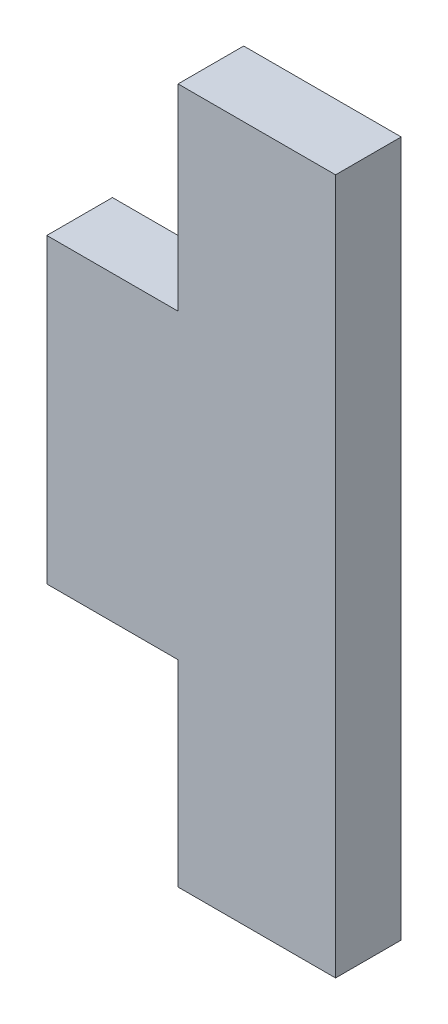
ISO-10303-21;
HEADER;
FILE_DESCRIPTION(('STEP AP214'),'2;1');
FILE_NAME('part.step','',(''),(''),'','','');
FILE_SCHEMA(('AUTOMOTIVE_DESIGN { 1 0 10303 214 1 1 1 1 }'));
ENDSEC;
DATA;
#1=APPLICATION_CONTEXT('core data for automotive mechanical design processes');
#2=APPLICATION_PROTOCOL_DEFINITION('international standard','automotive_design',2000,#1);
#3=PRODUCT_CONTEXT('',#1,'mechanical');
#4=PRODUCT('Part','Part','',(#3));
#5=PRODUCT_RELATED_PRODUCT_CATEGORY('part','',(#4));
#6=PRODUCT_DEFINITION_FORMATION('','',#4);
#7=PRODUCT_DEFINITION_CONTEXT('part definition',#1,'design');
#8=PRODUCT_DEFINITION('design','',#6,#7);
#9=PRODUCT_DEFINITION_SHAPE('','',#8);
#10=(LENGTH_UNIT() NAMED_UNIT(*) SI_UNIT(.MILLI.,.METRE.));
#11=(NAMED_UNIT(*) PLANE_ANGLE_UNIT() SI_UNIT($,.RADIAN.));
#12=(NAMED_UNIT(*) SI_UNIT($,.STERADIAN.) SOLID_ANGLE_UNIT());
#13=UNCERTAINTY_MEASURE_WITH_UNIT(LENGTH_MEASURE(1.E-05),#10,'distance_accuracy_value','');
#14=(GEOMETRIC_REPRESENTATION_CONTEXT(3) GLOBAL_UNCERTAINTY_ASSIGNED_CONTEXT((#13)) GLOBAL_UNIT_ASSIGNED_CONTEXT((#10,
#11,#12)) REPRESENTATION_CONTEXT('',''));
#15=CARTESIAN_POINT('',(0.,0.,0.));
#16=DIRECTION('',(0.,0.,1.));
#17=DIRECTION('',(1.,0.,0.));
#18=AXIS2_PLACEMENT_3D('',#15,#16,#17);
#19=CARTESIAN_POINT('',(0.,-6.731,1.27));
#20=DIRECTION('',(0.,1.,0.));
#21=DIRECTION('',(-1.,0.,0.));
#22=AXIS2_PLACEMENT_3D('',#19,#20,#21);
#23=PLANE('',#22);
#24=DIRECTION('',(1.,0.,0.));
#25=VECTOR('',#24,1.);
#26=CARTESIAN_POINT('',(0.,-6.731,0.));
#27=LINE('',#26,#25);
#28=CARTESIAN_POINT('',(1.27,-6.731,0.));
#29=VERTEX_POINT('',#28);
#30=CARTESIAN_POINT('',(4.318,-6.731,0.));
#31=VERTEX_POINT('',#30);
#32=EDGE_CURVE('E134',#29,#31,#27,.T.);
#33=ORIENTED_EDGE('',*,*,#32,.T.);
#34=DIRECTION('',(0.,0.,-1.));
#35=VECTOR('',#34,1.);
#36=CARTESIAN_POINT('',(4.318,-6.731,1.27));
#37=LINE('',#36,#35);
#38=CARTESIAN_POINT('',(4.318,-6.731,1.27));
#39=VERTEX_POINT('',#38);
#40=EDGE_CURVE('E11',#39,#31,#37,.T.);
#41=ORIENTED_EDGE('',*,*,#40,.F.);
#42=DIRECTION('',(1.,0.,0.));
#43=VECTOR('',#42,1.);
#44=CARTESIAN_POINT('',(0.,-6.731,1.27));
#45=LINE('',#44,#43);
#46=CARTESIAN_POINT('',(1.27,-6.731,1.27));
#47=VERTEX_POINT('',#46);
#48=EDGE_CURVE('E174',#47,#39,#45,.T.);
#49=ORIENTED_EDGE('',*,*,#48,.F.);
#50=DIRECTION('',(0.,0.,-1.));
#51=VECTOR('',#50,1.);
#52=CARTESIAN_POINT('',(1.27,-6.731,1.27));
#53=LINE('',#52,#51);
#54=EDGE_CURVE('E52',#47,#29,#53,.T.);
#55=ORIENTED_EDGE('',*,*,#54,.T.);
#56=EDGE_LOOP('',(#33,#41,#49,#55));
#57=FACE_BOUND('',#56,.T.);
#58=ADVANCED_FACE('F36',(#57),#23,.F.);
#59=CARTESIAN_POINT('',(4.318,0.,1.27));
#60=DIRECTION('',(-1.,0.,0.));
#61=DIRECTION('',(0.,-1.,0.));
#62=AXIS2_PLACEMENT_3D('',#59,#60,#61);
#63=PLANE('',#62);
#64=DIRECTION('',(0.,1.,0.));
#65=VECTOR('',#64,1.);
#66=CARTESIAN_POINT('',(4.318,0.,0.));
#67=LINE('',#66,#65);
#68=CARTESIAN_POINT('',(4.318,6.731,0.));
#69=VERTEX_POINT('',#68);
#70=EDGE_CURVE('E136',#31,#69,#67,.T.);
#71=ORIENTED_EDGE('',*,*,#70,.T.);
#72=DIRECTION('',(0.,0.,-1.));
#73=VECTOR('',#72,1.);
#74=CARTESIAN_POINT('',(4.318,6.731,1.27));
#75=LINE('',#74,#73);
#76=CARTESIAN_POINT('',(4.318,6.731,1.27));
#77=VERTEX_POINT('',#76);
#78=EDGE_CURVE('E44',#77,#69,#75,.T.);
#79=ORIENTED_EDGE('',*,*,#78,.F.);
#80=DIRECTION('',(0.,1.,0.));
#81=VECTOR('',#80,1.);
#82=CARTESIAN_POINT('',(4.318,0.,1.27));
#83=LINE('',#82,#81);
#84=EDGE_CURVE('E91',#39,#77,#83,.T.);
#85=ORIENTED_EDGE('',*,*,#84,.F.);
#86=ORIENTED_EDGE('',*,*,#40,.T.);
#87=EDGE_LOOP('',(#71,#79,#85,#86));
#88=FACE_BOUND('',#87,.T.);
#89=ADVANCED_FACE('F164',(#88),#63,.F.);
#90=CARTESIAN_POINT('',(0.,6.731,1.27));
#91=DIRECTION('',(0.,1.,0.));
#92=DIRECTION('',(-1.,0.,0.));
#93=AXIS2_PLACEMENT_3D('',#90,#91,#92);
#94=PLANE('',#93);
#95=DIRECTION('',(1.,0.,0.));
#96=VECTOR('',#95,1.);
#97=CARTESIAN_POINT('',(0.,6.731,0.));
#98=LINE('',#97,#96);
#99=CARTESIAN_POINT('',(1.27,6.731,0.));
#100=VERTEX_POINT('',#99);
#101=EDGE_CURVE('E139',#100,#69,#98,.T.);
#102=ORIENTED_EDGE('',*,*,#101,.F.);
#103=DIRECTION('',(0.,0.,-1.));
#104=VECTOR('',#103,1.);
#105=CARTESIAN_POINT('',(1.27,6.731,1.27));
#106=LINE('',#105,#104);
#107=CARTESIAN_POINT('',(1.27,6.731,1.27));
#108=VERTEX_POINT('',#107);
#109=EDGE_CURVE('E157',#108,#100,#106,.T.);
#110=ORIENTED_EDGE('',*,*,#109,.F.);
#111=DIRECTION('',(1.,0.,0.));
#112=VECTOR('',#111,1.);
#113=CARTESIAN_POINT('',(0.,6.731,1.27));
#114=LINE('',#113,#112);
#115=EDGE_CURVE('E163',#108,#77,#114,.T.);
#116=ORIENTED_EDGE('',*,*,#115,.T.);
#117=ORIENTED_EDGE('',*,*,#78,.T.);
#118=EDGE_LOOP('',(#102,#110,#116,#117));
#119=FACE_BOUND('',#118,.T.);
#120=ADVANCED_FACE('F161',(#119),#94,.T.);
#121=CARTESIAN_POINT('',(1.27,0.,1.27));
#122=DIRECTION('',(-1.,0.,0.));
#123=DIRECTION('',(0.,-1.,0.));
#124=AXIS2_PLACEMENT_3D('',#121,#122,#123);
#125=PLANE('',#124);
#126=DIRECTION('',(0.,1.,0.));
#127=VECTOR('',#126,1.);
#128=CARTESIAN_POINT('',(1.27,0.,0.));
#129=LINE('',#128,#127);
#130=CARTESIAN_POINT('',(1.27,2.921,0.));
#131=VERTEX_POINT('',#130);
#132=EDGE_CURVE('E142',#131,#100,#129,.T.);
#133=ORIENTED_EDGE('',*,*,#132,.F.);
#134=DIRECTION('',(0.,0.,-1.));
#135=VECTOR('',#134,1.);
#136=CARTESIAN_POINT('',(1.27,2.921,1.27));
#137=LINE('',#136,#135);
#138=CARTESIAN_POINT('',(1.27,2.921,1.27));
#139=VERTEX_POINT('',#138);
#140=EDGE_CURVE('E155',#139,#131,#137,.T.);
#141=ORIENTED_EDGE('',*,*,#140,.F.);
#142=DIRECTION('',(0.,1.,0.));
#143=VECTOR('',#142,1.);
#144=CARTESIAN_POINT('',(1.27,0.,1.27));
#145=LINE('',#144,#143);
#146=EDGE_CURVE('E130',#139,#108,#145,.T.);
#147=ORIENTED_EDGE('',*,*,#146,.T.);
#148=ORIENTED_EDGE('',*,*,#109,.T.);
#149=EDGE_LOOP('',(#133,#141,#147,#148));
#150=FACE_BOUND('',#149,.T.);
#151=ADVANCED_FACE('F171',(#150),#125,.T.);
#152=CARTESIAN_POINT('',(0.,2.921,1.27));
#153=DIRECTION('',(0.,1.,0.));
#154=DIRECTION('',(0.,0.,1.));
#155=AXIS2_PLACEMENT_3D('',#152,#153,#154);
#156=PLANE('',#155);
#157=DIRECTION('',(1.,0.,0.));
#158=VECTOR('',#157,1.);
#159=CARTESIAN_POINT('',(0.,2.921,0.));
#160=LINE('',#159,#158);
#161=CARTESIAN_POINT('',(-1.27,2.921,0.));
#162=VERTEX_POINT('',#161);
#163=EDGE_CURVE('E145',#162,#131,#160,.T.);
#164=ORIENTED_EDGE('',*,*,#163,.F.);
#165=DIRECTION('',(0.,0.,-1.));
#166=VECTOR('',#165,1.);
#167=CARTESIAN_POINT('',(-1.27,2.921,1.27));
#168=LINE('',#167,#166);
#169=CARTESIAN_POINT('',(-1.27,2.921,1.27));
#170=VERTEX_POINT('',#169);
#171=EDGE_CURVE('E116',#170,#162,#168,.T.);
#172=ORIENTED_EDGE('',*,*,#171,.F.);
#173=DIRECTION('',(1.,0.,0.));
#174=VECTOR('',#173,1.);
#175=CARTESIAN_POINT('',(0.,2.921,1.27));
#176=LINE('',#175,#174);
#177=EDGE_CURVE('E128',#170,#139,#176,.T.);
#178=ORIENTED_EDGE('',*,*,#177,.T.);
#179=ORIENTED_EDGE('',*,*,#140,.T.);
#180=EDGE_LOOP('',(#164,#172,#178,#179));
#181=FACE_BOUND('',#180,.T.);
#182=ADVANCED_FACE('F189',(#181),#156,.T.);
#183=CARTESIAN_POINT('',(-1.27,0.,1.27));
#184=DIRECTION('',(-1.,0.,0.));
#185=DIRECTION('',(0.,0.,1.));
#186=AXIS2_PLACEMENT_3D('',#183,#184,#185);
#187=PLANE('',#186);
#188=DIRECTION('',(0.,1.,0.));
#189=VECTOR('',#188,1.);
#190=CARTESIAN_POINT('',(-1.27,0.,0.));
#191=LINE('',#190,#189);
#192=CARTESIAN_POINT('',(-1.27,-2.921,0.));
#193=VERTEX_POINT('',#192);
#194=EDGE_CURVE('E113',#193,#162,#191,.T.);
#195=ORIENTED_EDGE('',*,*,#194,.F.);
#196=DIRECTION('',(0.,0.,-1.));
#197=VECTOR('',#196,1.);
#198=CARTESIAN_POINT('',(-1.27,-2.921,1.27));
#199=LINE('',#198,#197);
#200=CARTESIAN_POINT('',(-1.27,-2.921,1.27));
#201=VERTEX_POINT('',#200);
#202=EDGE_CURVE('E107',#201,#193,#199,.T.);
#203=ORIENTED_EDGE('',*,*,#202,.F.);
#204=DIRECTION('',(0.,1.,0.));
#205=VECTOR('',#204,1.);
#206=CARTESIAN_POINT('',(-1.27,0.,1.27));
#207=LINE('',#206,#205);
#208=EDGE_CURVE('E111',#201,#170,#207,.T.);
#209=ORIENTED_EDGE('',*,*,#208,.T.);
#210=ORIENTED_EDGE('',*,*,#171,.T.);
#211=EDGE_LOOP('',(#195,#203,#209,#210));
#212=FACE_BOUND('',#211,.T.);
#213=ADVANCED_FACE('F109',(#212),#187,.T.);
#214=CARTESIAN_POINT('',(0.,-2.921,1.27));
#215=DIRECTION('',(0.,1.,0.));
#216=DIRECTION('',(0.,0.,1.));
#217=AXIS2_PLACEMENT_3D('',#214,#215,#216);
#218=PLANE('',#217);
#219=DIRECTION('',(1.,0.,0.));
#220=VECTOR('',#219,1.);
#221=CARTESIAN_POINT('',(0.,-2.921,0.));
#222=LINE('',#221,#220);
#223=CARTESIAN_POINT('',(1.27,-2.921,0.));
#224=VERTEX_POINT('',#223);
#225=EDGE_CURVE('E150',#193,#224,#222,.T.);
#226=ORIENTED_EDGE('',*,*,#225,.T.);
#227=DIRECTION('',(0.,0.,-1.));
#228=VECTOR('',#227,1.);
#229=CARTESIAN_POINT('',(1.27,-2.921,1.27));
#230=LINE('',#229,#228);
#231=CARTESIAN_POINT('',(1.27,-2.921,1.27));
#232=VERTEX_POINT('',#231);
#233=EDGE_CURVE('E79',#232,#224,#230,.T.);
#234=ORIENTED_EDGE('',*,*,#233,.F.);
#235=DIRECTION('',(1.,0.,0.));
#236=VECTOR('',#235,1.);
#237=CARTESIAN_POINT('',(0.,-2.921,1.27));
#238=LINE('',#237,#236);
#239=EDGE_CURVE('E118',#201,#232,#238,.T.);
#240=ORIENTED_EDGE('',*,*,#239,.F.);
#241=ORIENTED_EDGE('',*,*,#202,.T.);
#242=EDGE_LOOP('',(#226,#234,#240,#241));
#243=FACE_BOUND('',#242,.T.);
#244=ADVANCED_FACE('F119',(#243),#218,.F.);
#245=EDGE_CURVE('E146',#29,#224,#129,.T.);
#246=ORIENTED_EDGE('',*,*,#245,.F.);
#247=ORIENTED_EDGE('',*,*,#54,.F.);
#248=EDGE_CURVE('E122',#47,#232,#145,.T.);
#249=ORIENTED_EDGE('',*,*,#248,.T.);
#250=ORIENTED_EDGE('',*,*,#233,.T.);
#251=EDGE_LOOP('',(#246,#247,#249,#250));
#252=FACE_BOUND('',#251,.T.);
#253=ADVANCED_FACE('F178',(#252),#125,.T.);
#254=CARTESIAN_POINT('',(0.,0.,1.27));
#255=DIRECTION('',(0.,0.,1.));
#256=DIRECTION('',(1.,0.,0.));
#257=AXIS2_PLACEMENT_3D('',#254,#255,#256);
#258=PLANE('',#257);
#259=ORIENTED_EDGE('',*,*,#48,.T.);
#260=ORIENTED_EDGE('',*,*,#84,.T.);
#261=ORIENTED_EDGE('',*,*,#115,.F.);
#262=ORIENTED_EDGE('',*,*,#146,.F.);
#263=ORIENTED_EDGE('',*,*,#177,.F.);
#264=ORIENTED_EDGE('',*,*,#208,.F.);
#265=ORIENTED_EDGE('',*,*,#239,.T.);
#266=ORIENTED_EDGE('',*,*,#248,.F.);
#267=EDGE_LOOP('',(#259,#260,#261,#262,#263,#264,#265,#266));
#268=FACE_BOUND('',#267,.T.);
#269=ADVANCED_FACE('F125',(#268),#258,.T.);
#270=CARTESIAN_POINT('',(0.,0.,0.));
#271=DIRECTION('',(0.,0.,1.));
#272=DIRECTION('',(1.,0.,0.));
#273=AXIS2_PLACEMENT_3D('',#270,#271,#272);
#274=PLANE('',#273);
#275=ORIENTED_EDGE('',*,*,#32,.F.);
#276=ORIENTED_EDGE('',*,*,#245,.T.);
#277=ORIENTED_EDGE('',*,*,#225,.F.);
#278=ORIENTED_EDGE('',*,*,#194,.T.);
#279=ORIENTED_EDGE('',*,*,#163,.T.);
#280=ORIENTED_EDGE('',*,*,#132,.T.);
#281=ORIENTED_EDGE('',*,*,#101,.T.);
#282=ORIENTED_EDGE('',*,*,#70,.F.);
#283=EDGE_LOOP('',(#275,#276,#277,#278,#279,#280,#281,#282));
#284=FACE_BOUND('',#283,.T.);
#285=ADVANCED_FACE('F167',(#284),#274,.F.);
#286=CLOSED_SHELL('',(#58,#89,#120,#151,#182,#213,#244,#253,#269,#285));
#287=MANIFOLD_SOLID_BREP('B2',#286);
#288=ADVANCED_BREP_SHAPE_REPRESENTATION('',(#18,#287),#14);
#289=SHAPE_DEFINITION_REPRESENTATION(#9,#288);
ENDSEC;
END-ISO-10303-21;
